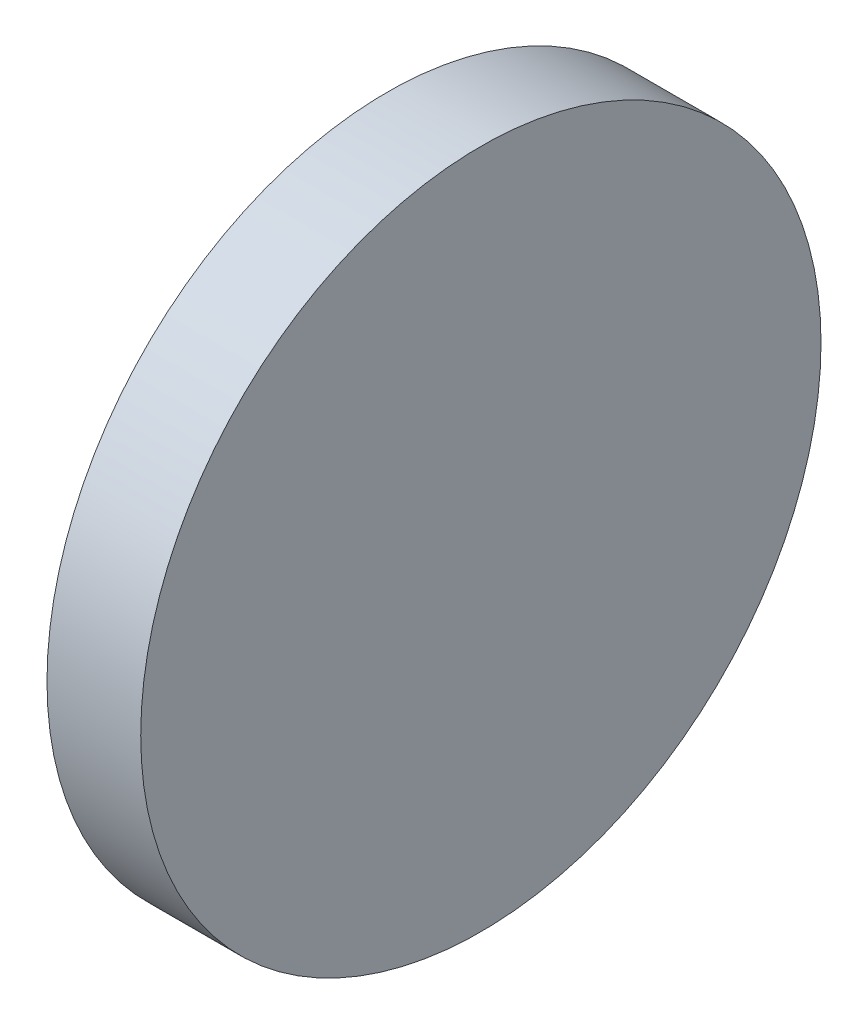
ISO-10303-21;
HEADER;
FILE_DESCRIPTION(('STEP AP214'),'2;1');
FILE_NAME('part.step','',(''),(''),'','','');
FILE_SCHEMA(('AUTOMOTIVE_DESIGN { 1 0 10303 214 1 1 1 1 }'));
ENDSEC;
DATA;
#1=APPLICATION_CONTEXT('core data for automotive mechanical design processes');
#2=APPLICATION_PROTOCOL_DEFINITION('international standard','automotive_design',2000,#1);
#3=PRODUCT_CONTEXT('',#1,'mechanical');
#4=PRODUCT('Part','Part','',(#3));
#5=PRODUCT_RELATED_PRODUCT_CATEGORY('part','',(#4));
#6=PRODUCT_DEFINITION_FORMATION('','',#4);
#7=PRODUCT_DEFINITION_CONTEXT('part definition',#1,'design');
#8=PRODUCT_DEFINITION('design','',#6,#7);
#9=PRODUCT_DEFINITION_SHAPE('','',#8);
#10=(LENGTH_UNIT() NAMED_UNIT(*) SI_UNIT(.MILLI.,.METRE.));
#11=(NAMED_UNIT(*) PLANE_ANGLE_UNIT() SI_UNIT($,.RADIAN.));
#12=(NAMED_UNIT(*) SI_UNIT($,.STERADIAN.) SOLID_ANGLE_UNIT());
#13=UNCERTAINTY_MEASURE_WITH_UNIT(LENGTH_MEASURE(1.E-05),#10,'distance_accuracy_value','');
#14=(GEOMETRIC_REPRESENTATION_CONTEXT(3) GLOBAL_UNCERTAINTY_ASSIGNED_CONTEXT((#13)) GLOBAL_UNIT_ASSIGNED_CONTEXT((#10,
#11,#12)) REPRESENTATION_CONTEXT('',''));
#15=CARTESIAN_POINT('',(0.,0.,0.));
#16=DIRECTION('',(0.,0.,1.));
#17=DIRECTION('',(1.,0.,0.));
#18=AXIS2_PLACEMENT_3D('',#15,#16,#17);
#19=CARTESIAN_POINT('',(0.,0.,0.));
#20=DIRECTION('',(-1.,0.,0.));
#21=DIRECTION('',(0.,0.,1.));
#22=AXIS2_PLACEMENT_3D('',#19,#20,#21);
#23=CYLINDRICAL_SURFACE('',#22,12.7);
#24=CARTESIAN_POINT('',(0.,0.,0.));
#25=DIRECTION('',(-1.,0.,0.));
#26=DIRECTION('',(0.,0.,1.));
#27=AXIS2_PLACEMENT_3D('',#24,#25,#26);
#28=CIRCLE('',#27,12.7);
#29=CARTESIAN_POINT('',(0.,0.,12.7));
#30=VERTEX_POINT('',#29);
#31=EDGE_CURVE('E44',#30,#30,#28,.T.);
#32=ORIENTED_EDGE('',*,*,#31,.F.);
#33=EDGE_LOOP('',(#32));
#34=FACE_BOUND('',#33,.T.);
#35=CARTESIAN_POINT('',(3.5,0.,0.));
#36=DIRECTION('',(-1.,0.,0.));
#37=DIRECTION('',(0.,0.,1.));
#38=AXIS2_PLACEMENT_3D('',#35,#36,#37);
#39=CIRCLE('',#38,12.7);
#40=CARTESIAN_POINT('',(3.5,0.,12.7));
#41=VERTEX_POINT('',#40);
#42=EDGE_CURVE('E10',#41,#41,#39,.T.);
#43=ORIENTED_EDGE('',*,*,#42,.T.);
#44=EDGE_LOOP('',(#43));
#45=FACE_BOUND('',#44,.T.);
#46=ADVANCED_FACE('F37',(#34,#45),#23,.T.);
#47=CARTESIAN_POINT('',(3.5,12.7,0.));
#48=DIRECTION('',(-1.,0.,0.));
#49=DIRECTION('',(0.,0.,1.));
#50=AXIS2_PLACEMENT_3D('',#47,#48,#49);
#51=PLANE('',#50);
#52=ORIENTED_EDGE('',*,*,#42,.F.);
#53=EDGE_LOOP('',(#52));
#54=FACE_BOUND('',#53,.T.);
#55=ADVANCED_FACE('F54',(#54),#51,.F.);
#56=CARTESIAN_POINT('',(0.,12.7,0.));
#57=DIRECTION('',(1.,0.,0.));
#58=DIRECTION('',(0.,0.,-1.));
#59=AXIS2_PLACEMENT_3D('',#56,#57,#58);
#60=PLANE('',#59);
#61=ORIENTED_EDGE('',*,*,#31,.T.);
#62=EDGE_LOOP('',(#61));
#63=FACE_BOUND('',#62,.T.);
#64=ADVANCED_FACE('F51',(#63),#60,.F.);
#65=CLOSED_SHELL('',(#46,#55,#64));
#66=MANIFOLD_SOLID_BREP('B2',#65);
#67=ADVANCED_BREP_SHAPE_REPRESENTATION('',(#18,#66),#14);
#68=SHAPE_DEFINITION_REPRESENTATION(#9,#67);
ENDSEC;
END-ISO-10303-21;
